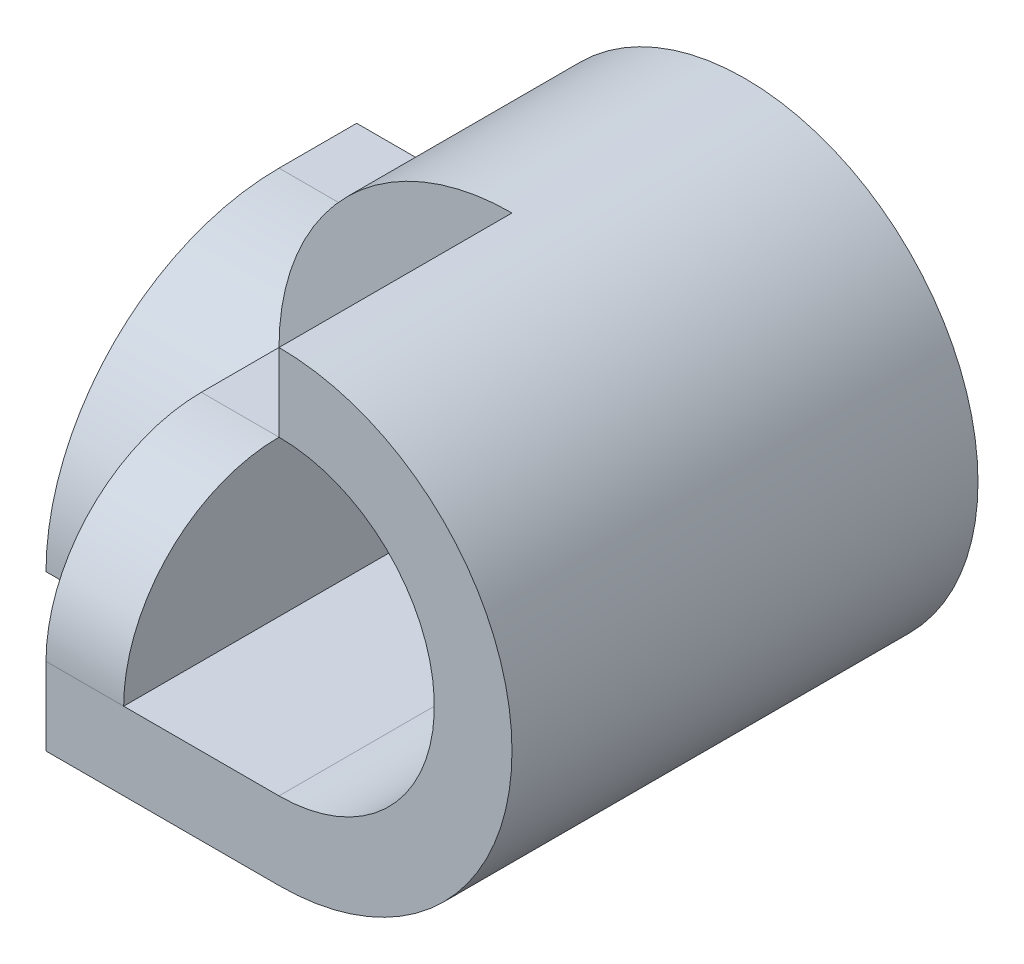
ISO-10303-21;
HEADER;
FILE_DESCRIPTION(('STEP AP214'),'2;1');
FILE_NAME('part.step','',(''),(''),'','','');
FILE_SCHEMA(('AUTOMOTIVE_DESIGN { 1 0 10303 214 1 1 1 1 }'));
ENDSEC;
DATA;
#1=APPLICATION_CONTEXT('core data for automotive mechanical design processes');
#2=APPLICATION_PROTOCOL_DEFINITION('international standard','automotive_design',2000,#1);
#3=PRODUCT_CONTEXT('',#1,'mechanical');
#4=PRODUCT('Part','Part','',(#3));
#5=PRODUCT_RELATED_PRODUCT_CATEGORY('part','',(#4));
#6=PRODUCT_DEFINITION_FORMATION('','',#4);
#7=PRODUCT_DEFINITION_CONTEXT('part definition',#1,'design');
#8=PRODUCT_DEFINITION('design','',#6,#7);
#9=PRODUCT_DEFINITION_SHAPE('','',#8);
#10=(LENGTH_UNIT() NAMED_UNIT(*) SI_UNIT(.MILLI.,.METRE.));
#11=(NAMED_UNIT(*) PLANE_ANGLE_UNIT() SI_UNIT($,.RADIAN.));
#12=(NAMED_UNIT(*) SI_UNIT($,.STERADIAN.) SOLID_ANGLE_UNIT());
#13=UNCERTAINTY_MEASURE_WITH_UNIT(LENGTH_MEASURE(1.E-05),#10,'distance_accuracy_value','');
#14=(GEOMETRIC_REPRESENTATION_CONTEXT(3) GLOBAL_UNCERTAINTY_ASSIGNED_CONTEXT((#13)) GLOBAL_UNIT_ASSIGNED_CONTEXT((#10,
#11,#12)) REPRESENTATION_CONTEXT('',''));
#15=CARTESIAN_POINT('',(0.,0.,0.));
#16=DIRECTION('',(0.,0.,1.));
#17=DIRECTION('',(1.,0.,0.));
#18=AXIS2_PLACEMENT_3D('',#15,#16,#17);
#19=CARTESIAN_POINT('',(-1.,0.,6.));
#20=DIRECTION('',(-1.,0.,0.));
#21=DIRECTION('',(0.,0.,1.));
#22=AXIS2_PLACEMENT_3D('',#19,#20,#21);
#23=PLANE('',#22);
#24=CARTESIAN_POINT('',(-1.,0.,4.));
#25=DIRECTION('',(1.,0.,0.));
#26=DIRECTION('',(0.,0.,-1.));
#27=AXIS2_PLACEMENT_3D('',#24,#25,#26);
#28=CIRCLE('',#27,2.);
#29=CARTESIAN_POINT('',(-1.,2.,4.));
#30=VERTEX_POINT('',#29);
#31=CARTESIAN_POINT('',(-1.,0.,6.));
#32=VERTEX_POINT('',#31);
#33=EDGE_CURVE('E193',#30,#32,#28,.T.);
#34=ORIENTED_EDGE('',*,*,#33,.F.);
#35=DIRECTION('',(0.,0.,1.));
#36=VECTOR('',#35,1.);
#37=CARTESIAN_POINT('',(-1.,2.,3.));
#38=LINE('',#37,#36);
#39=CARTESIAN_POINT('',(-1.,2.,3.));
#40=VERTEX_POINT('',#39);
#41=EDGE_CURVE('E252',#40,#30,#38,.T.);
#42=ORIENTED_EDGE('',*,*,#41,.F.);
#43=DIRECTION('',(0.,0.,-1.));
#44=VECTOR('',#43,1.);
#45=CARTESIAN_POINT('',(-1.,2.,6.));
#46=LINE('',#45,#44);
#47=CARTESIAN_POINT('',(-1.,2.,1.));
#48=VERTEX_POINT('',#47);
#49=EDGE_CURVE('E183',#40,#48,#46,.T.);
#50=ORIENTED_EDGE('',*,*,#49,.T.);
#51=CARTESIAN_POINT('',(-1.,-1.,1.));
#52=DIRECTION('',(-1.,0.,0.));
#53=DIRECTION('',(0.,0.,-1.));
#54=AXIS2_PLACEMENT_3D('',#51,#52,#53);
#55=CIRCLE('',#54,3.);
#56=CARTESIAN_POINT('',(-1.,-0.999999999999999,4.));
#57=VERTEX_POINT('',#56);
#58=EDGE_CURVE('E213',#57,#48,#55,.T.);
#59=ORIENTED_EDGE('',*,*,#58,.F.);
#60=DIRECTION('',(0.,0.,-1.));
#61=VECTOR('',#60,1.);
#62=CARTESIAN_POINT('',(-1.,-1.,6.));
#63=LINE('',#62,#61);
#64=CARTESIAN_POINT('',(-1.,-1.,6.));
#65=VERTEX_POINT('',#64);
#66=EDGE_CURVE('E89',#65,#57,#63,.T.);
#67=ORIENTED_EDGE('',*,*,#66,.F.);
#68=DIRECTION('',(0.,1.,0.));
#69=VECTOR('',#68,1.);
#70=CARTESIAN_POINT('',(-1.,0.,6.));
#71=LINE('',#70,#69);
#72=EDGE_CURVE('E154',#65,#32,#71,.T.);
#73=ORIENTED_EDGE('',*,*,#72,.T.);
#74=EDGE_LOOP('',(#34,#42,#50,#59,#67,#73));
#75=FACE_BOUND('',#74,.T.);
#76=ADVANCED_FACE('F34',(#75),#23,.T.);
#77=CARTESIAN_POINT('',(0.,0.,6.));
#78=DIRECTION('',(-1.,0.,0.));
#79=DIRECTION('',(0.,0.,1.));
#80=AXIS2_PLACEMENT_3D('',#77,#78,#79);
#81=PLANE('',#80);
#82=DIRECTION('',(0.,0.,-1.));
#83=VECTOR('',#82,1.);
#84=CARTESIAN_POINT('',(0.,2.,6.));
#85=LINE('',#84,#83);
#86=CARTESIAN_POINT('',(0.,2.,3.));
#87=VERTEX_POINT('',#86);
#88=CARTESIAN_POINT('',(0.,2.,4.));
#89=VERTEX_POINT('',#88);
#90=EDGE_CURVE('E197',#87,#89,#85,.F.);
#91=ORIENTED_EDGE('',*,*,#90,.T.);
#92=CARTESIAN_POINT('',(0.,0.,4.));
#93=DIRECTION('',(-1.,0.,0.));
#94=DIRECTION('',(0.,0.,1.));
#95=AXIS2_PLACEMENT_3D('',#92,#93,#94);
#96=CIRCLE('',#95,2.);
#97=CARTESIAN_POINT('',(0.,0.,6.));
#98=VERTEX_POINT('',#97);
#99=EDGE_CURVE('E190',#89,#98,#96,.F.);
#100=ORIENTED_EDGE('',*,*,#99,.T.);
#101=DIRECTION('',(0.,0.,-1.));
#102=VECTOR('',#101,1.);
#103=CARTESIAN_POINT('',(0.,0.,6.));
#104=LINE('',#103,#102);
#105=CARTESIAN_POINT('',(0.,0.,0.));
#106=VERTEX_POINT('',#105);
#107=EDGE_CURVE('E82',#98,#106,#104,.T.);
#108=ORIENTED_EDGE('',*,*,#107,.T.);
#109=DIRECTION('',(0.,1.,0.));
#110=VECTOR('',#109,1.);
#111=CARTESIAN_POINT('',(0.,0.,0.));
#112=LINE('',#111,#110);
#113=CARTESIAN_POINT('',(0.,2.,0.));
#114=VERTEX_POINT('',#113);
#115=EDGE_CURVE('E177',#106,#114,#112,.T.);
#116=ORIENTED_EDGE('',*,*,#115,.T.);
#117=DIRECTION('',(0.,0.,-1.));
#118=VECTOR('',#117,1.);
#119=CARTESIAN_POINT('',(0.,2.,6.));
#120=LINE('',#119,#118);
#121=EDGE_CURVE('E140',#87,#114,#120,.T.);
#122=ORIENTED_EDGE('',*,*,#121,.F.);
#123=EDGE_LOOP('',(#91,#100,#108,#116,#122));
#124=FACE_BOUND('',#123,.T.);
#125=ADVANCED_FACE('F195',(#124),#81,.F.);
#126=CARTESIAN_POINT('',(2.,2.,6.));
#127=DIRECTION('',(0.,0.,-1.));
#128=DIRECTION('',(-1.,0.,0.));
#129=AXIS2_PLACEMENT_3D('',#126,#127,#128);
#130=CYLINDRICAL_SURFACE('',#129,2.);
#131=DIRECTION('',(0.,0.,-1.));
#132=VECTOR('',#131,1.);
#133=CARTESIAN_POINT('',(2.,4.,6.));
#134=LINE('',#133,#132);
#135=CARTESIAN_POINT('',(2.,4.,6.));
#136=VERTEX_POINT('',#135);
#137=CARTESIAN_POINT('',(2.,4.,3.));
#138=VERTEX_POINT('',#137);
#139=EDGE_CURVE('E49',#136,#138,#134,.T.);
#140=ORIENTED_EDGE('',*,*,#139,.T.);
#141=CARTESIAN_POINT('',(2.,2.,3.));
#142=DIRECTION('',(0.,0.,-1.));
#143=DIRECTION('',(-1.,0.,0.));
#144=AXIS2_PLACEMENT_3D('',#141,#142,#143);
#145=CIRCLE('',#144,2.);
#146=EDGE_CURVE('E208',#138,#87,#145,.F.);
#147=ORIENTED_EDGE('',*,*,#146,.T.);
#148=ORIENTED_EDGE('',*,*,#121,.T.);
#149=CARTESIAN_POINT('',(2.,2.,0.));
#150=DIRECTION('',(0.,0.,1.));
#151=DIRECTION('',(1.,0.,0.));
#152=AXIS2_PLACEMENT_3D('',#149,#150,#151);
#153=CIRCLE('',#152,2.);
#154=CARTESIAN_POINT('',(2.,0.,0.));
#155=VERTEX_POINT('',#154);
#156=EDGE_CURVE('E159',#114,#155,#153,.F.);
#157=ORIENTED_EDGE('',*,*,#156,.T.);
#158=DIRECTION('',(0.,0.,-1.));
#159=VECTOR('',#158,1.);
#160=CARTESIAN_POINT('',(2.,0.,6.));
#161=LINE('',#160,#159);
#162=CARTESIAN_POINT('',(2.,0.,6.));
#163=VERTEX_POINT('',#162);
#164=EDGE_CURVE('E182',#163,#155,#161,.T.);
#165=ORIENTED_EDGE('',*,*,#164,.F.);
#166=CARTESIAN_POINT('',(2.,2.,6.));
#167=DIRECTION('',(0.,0.,1.));
#168=DIRECTION('',(1.,0.,0.));
#169=AXIS2_PLACEMENT_3D('',#166,#167,#168);
#170=CIRCLE('',#169,2.);
#171=EDGE_CURVE('E57',#136,#163,#170,.F.);
#172=ORIENTED_EDGE('',*,*,#171,.F.);
#173=EDGE_LOOP('',(#140,#147,#148,#157,#165,#172));
#174=FACE_BOUND('',#173,.T.);
#175=ADVANCED_FACE('F207',(#174),#130,.F.);
#176=CARTESIAN_POINT('',(2.,2.,6.));
#177=DIRECTION('',(0.,0.,-1.));
#178=DIRECTION('',(-1.,0.,0.));
#179=AXIS2_PLACEMENT_3D('',#176,#177,#178);
#180=CYLINDRICAL_SURFACE('',#179,3.);
#181=CARTESIAN_POINT('',(2.,2.,3.));
#182=DIRECTION('',(0.,0.,-1.));
#183=DIRECTION('',(-1.,0.,0.));
#184=AXIS2_PLACEMENT_3D('',#181,#182,#183);
#185=CIRCLE('',#184,3.);
#186=CARTESIAN_POINT('',(2.,5.,3.));
#187=VERTEX_POINT('',#186);
#188=EDGE_CURVE('E11',#187,#40,#185,.F.);
#189=ORIENTED_EDGE('',*,*,#188,.F.);
#190=DIRECTION('',(0.,0.,-1.));
#191=VECTOR('',#190,1.);
#192=CARTESIAN_POINT('',(2.,5.,6.));
#193=LINE('',#192,#191);
#194=CARTESIAN_POINT('',(2.,5.,6.));
#195=VERTEX_POINT('',#194);
#196=EDGE_CURVE('E137',#195,#187,#193,.T.);
#197=ORIENTED_EDGE('',*,*,#196,.F.);
#198=CARTESIAN_POINT('',(2.,2.,6.));
#199=DIRECTION('',(0.,0.,1.));
#200=DIRECTION('',(1.,0.,0.));
#201=AXIS2_PLACEMENT_3D('',#198,#199,#200);
#202=CIRCLE('',#201,3.);
#203=CARTESIAN_POINT('',(2.,-1.,6.));
#204=VERTEX_POINT('',#203);
#205=EDGE_CURVE('E143',#195,#204,#202,.F.);
#206=ORIENTED_EDGE('',*,*,#205,.T.);
#207=DIRECTION('',(0.,0.,-1.));
#208=VECTOR('',#207,1.);
#209=CARTESIAN_POINT('',(2.,-1.,6.));
#210=LINE('',#209,#208);
#211=CARTESIAN_POINT('',(2.,-1.,0.));
#212=VERTEX_POINT('',#211);
#213=EDGE_CURVE('E170',#204,#212,#210,.T.);
#214=ORIENTED_EDGE('',*,*,#213,.T.);
#215=CARTESIAN_POINT('',(2.,2.,0.));
#216=DIRECTION('',(0.,0.,1.));
#217=DIRECTION('',(1.,0.,0.));
#218=AXIS2_PLACEMENT_3D('',#215,#216,#217);
#219=CIRCLE('',#218,3.);
#220=CARTESIAN_POINT('',(-1.,2.,0.));
#221=VERTEX_POINT('',#220);
#222=EDGE_CURVE('E171',#221,#212,#219,.F.);
#223=ORIENTED_EDGE('',*,*,#222,.F.);
#224=DIRECTION('',(0.,0.,-1.));
#225=VECTOR('',#224,1.);
#226=CARTESIAN_POINT('',(-1.,2.,0.));
#227=LINE('',#226,#225);
#228=EDGE_CURVE('E211',#48,#221,#227,.T.);
#229=ORIENTED_EDGE('',*,*,#228,.F.);
#230=ORIENTED_EDGE('',*,*,#49,.F.);
#231=EDGE_LOOP('',(#189,#197,#206,#214,#223,#229,#230));
#232=FACE_BOUND('',#231,.T.);
#233=ADVANCED_FACE('F36',(#232),#180,.T.);
#234=CARTESIAN_POINT('',(0.,-1.,6.));
#235=DIRECTION('',(0.,1.,0.));
#236=DIRECTION('',(0.,0.,1.));
#237=AXIS2_PLACEMENT_3D('',#234,#235,#236);
#238=PLANE('',#237);
#239=DIRECTION('',(1.,0.,0.));
#240=VECTOR('',#239,1.);
#241=CARTESIAN_POINT('',(0.,-1.,0.));
#242=LINE('',#241,#240);
#243=CARTESIAN_POINT('',(-3.,-1.,0.));
#244=VERTEX_POINT('',#243);
#245=EDGE_CURVE('E174',#244,#212,#242,.T.);
#246=ORIENTED_EDGE('',*,*,#245,.T.);
#247=ORIENTED_EDGE('',*,*,#213,.F.);
#248=DIRECTION('',(1.,0.,0.));
#249=VECTOR('',#248,1.);
#250=CARTESIAN_POINT('',(0.,-1.,6.));
#251=LINE('',#250,#249);
#252=EDGE_CURVE('E152',#65,#204,#251,.T.);
#253=ORIENTED_EDGE('',*,*,#252,.F.);
#254=ORIENTED_EDGE('',*,*,#66,.T.);
#255=DIRECTION('',(1.,0.,0.));
#256=VECTOR('',#255,1.);
#257=CARTESIAN_POINT('',(-3.,-0.999999999999999,4.));
#258=LINE('',#257,#256);
#259=CARTESIAN_POINT('',(-3.,-0.999999999999999,4.));
#260=VERTEX_POINT('',#259);
#261=EDGE_CURVE('E231',#260,#57,#258,.T.);
#262=ORIENTED_EDGE('',*,*,#261,.F.);
#263=DIRECTION('',(0.,0.,1.));
#264=VECTOR('',#263,1.);
#265=CARTESIAN_POINT('',(-3.,-1.,0.));
#266=LINE('',#265,#264);
#267=EDGE_CURVE('E223',#244,#260,#266,.T.);
#268=ORIENTED_EDGE('',*,*,#267,.F.);
#269=EDGE_LOOP('',(#246,#247,#253,#254,#262,#268));
#270=FACE_BOUND('',#269,.T.);
#271=ADVANCED_FACE('F244',(#270),#238,.F.);
#272=CARTESIAN_POINT('',(0.,0.,6.));
#273=DIRECTION('',(0.,1.,0.));
#274=DIRECTION('',(0.,0.,1.));
#275=AXIS2_PLACEMENT_3D('',#272,#273,#274);
#276=PLANE('',#275);
#277=DIRECTION('',(1.,0.,0.));
#278=VECTOR('',#277,1.);
#279=CARTESIAN_POINT('',(0.,0.,0.));
#280=LINE('',#279,#278);
#281=EDGE_CURVE('E155',#106,#155,#280,.T.);
#282=ORIENTED_EDGE('',*,*,#281,.F.);
#283=ORIENTED_EDGE('',*,*,#107,.F.);
#284=DIRECTION('',(1.,0.,0.));
#285=VECTOR('',#284,1.);
#286=CARTESIAN_POINT('',(0.,0.,6.));
#287=LINE('',#286,#285);
#288=EDGE_CURVE('E167',#98,#163,#287,.T.);
#289=ORIENTED_EDGE('',*,*,#288,.T.);
#290=ORIENTED_EDGE('',*,*,#164,.T.);
#291=EDGE_LOOP('',(#282,#283,#289,#290));
#292=FACE_BOUND('',#291,.T.);
#293=ADVANCED_FACE('F201',(#292),#276,.T.);
#294=CARTESIAN_POINT('',(0.,0.,6.));
#295=DIRECTION('',(0.,0.,1.));
#296=DIRECTION('',(1.,0.,0.));
#297=AXIS2_PLACEMENT_3D('',#294,#295,#296);
#298=PLANE('',#297);
#299=DIRECTION('',(-1.,0.,0.));
#300=VECTOR('',#299,1.);
#301=CARTESIAN_POINT('',(2.,0.,6.));
#302=LINE('',#301,#300);
#303=EDGE_CURVE('E42',#32,#98,#302,.F.);
#304=ORIENTED_EDGE('',*,*,#303,.F.);
#305=ORIENTED_EDGE('',*,*,#72,.F.);
#306=ORIENTED_EDGE('',*,*,#252,.T.);
#307=ORIENTED_EDGE('',*,*,#205,.F.);
#308=DIRECTION('',(0.,1.,0.));
#309=VECTOR('',#308,1.);
#310=CARTESIAN_POINT('',(2.,0.,6.));
#311=LINE('',#310,#309);
#312=EDGE_CURVE('E134',#136,#195,#311,.T.);
#313=ORIENTED_EDGE('',*,*,#312,.F.);
#314=ORIENTED_EDGE('',*,*,#171,.T.);
#315=ORIENTED_EDGE('',*,*,#288,.F.);
#316=EDGE_LOOP('',(#304,#305,#306,#307,#313,#314,#315));
#317=FACE_BOUND('',#316,.T.);
#318=ADVANCED_FACE('F150',(#317),#298,.T.);
#319=CARTESIAN_POINT('',(0.,0.,0.));
#320=DIRECTION('',(0.,0.,1.));
#321=DIRECTION('',(1.,0.,0.));
#322=AXIS2_PLACEMENT_3D('',#319,#320,#321);
#323=PLANE('',#322);
#324=ORIENTED_EDGE('',*,*,#222,.T.);
#325=ORIENTED_EDGE('',*,*,#245,.F.);
#326=DIRECTION('',(0.,-1.,0.));
#327=VECTOR('',#326,1.);
#328=CARTESIAN_POINT('',(-3.,2.,0.));
#329=LINE('',#328,#327);
#330=CARTESIAN_POINT('',(-3.,2.,0.));
#331=VERTEX_POINT('',#330);
#332=EDGE_CURVE('E220',#331,#244,#329,.T.);
#333=ORIENTED_EDGE('',*,*,#332,.F.);
#334=DIRECTION('',(1.,0.,0.));
#335=VECTOR('',#334,1.);
#336=CARTESIAN_POINT('',(-3.,2.,0.));
#337=LINE('',#336,#335);
#338=EDGE_CURVE('E162',#331,#221,#337,.T.);
#339=ORIENTED_EDGE('',*,*,#338,.T.);
#340=EDGE_LOOP('',(#324,#325,#333,#339));
#341=FACE_BOUND('',#340,.T.);
#342=ORIENTED_EDGE('',*,*,#115,.F.);
#343=ORIENTED_EDGE('',*,*,#281,.T.);
#344=ORIENTED_EDGE('',*,*,#156,.F.);
#345=EDGE_LOOP('',(#342,#343,#344));
#346=FACE_BOUND('',#345,.T.);
#347=ADVANCED_FACE('F204',(#341,#346),#323,.F.);
#348=CARTESIAN_POINT('',(-3.,2.,0.));
#349=DIRECTION('',(0.,-1.,0.));
#350=DIRECTION('',(0.,0.,-1.));
#351=AXIS2_PLACEMENT_3D('',#348,#349,#350);
#352=PLANE('',#351);
#353=ORIENTED_EDGE('',*,*,#228,.T.);
#354=ORIENTED_EDGE('',*,*,#338,.F.);
#355=DIRECTION('',(0.,0.,-1.));
#356=VECTOR('',#355,1.);
#357=CARTESIAN_POINT('',(-3.,2.,0.));
#358=LINE('',#357,#356);
#359=CARTESIAN_POINT('',(-3.,2.,1.));
#360=VERTEX_POINT('',#359);
#361=EDGE_CURVE('E217',#360,#331,#358,.T.);
#362=ORIENTED_EDGE('',*,*,#361,.F.);
#363=DIRECTION('',(1.,0.,0.));
#364=VECTOR('',#363,1.);
#365=CARTESIAN_POINT('',(-3.,2.,1.));
#366=LINE('',#365,#364);
#367=EDGE_CURVE('E226',#360,#48,#366,.T.);
#368=ORIENTED_EDGE('',*,*,#367,.T.);
#369=EDGE_LOOP('',(#353,#354,#362,#368));
#370=FACE_BOUND('',#369,.T.);
#371=ADVANCED_FACE('F248',(#370),#352,.F.);
#372=CARTESIAN_POINT('',(-3.,-1.,1.));
#373=DIRECTION('',(1.,0.,0.));
#374=DIRECTION('',(0.,0.,-1.));
#375=AXIS2_PLACEMENT_3D('',#372,#373,#374);
#376=CYLINDRICAL_SURFACE('',#375,3.);
#377=ORIENTED_EDGE('',*,*,#58,.T.);
#378=ORIENTED_EDGE('',*,*,#367,.F.);
#379=CARTESIAN_POINT('',(-3.,-1.,1.));
#380=DIRECTION('',(-1.,0.,0.));
#381=DIRECTION('',(0.,0.,-1.));
#382=AXIS2_PLACEMENT_3D('',#379,#380,#381);
#383=CIRCLE('',#382,3.);
#384=EDGE_CURVE('E225',#260,#360,#383,.T.);
#385=ORIENTED_EDGE('',*,*,#384,.F.);
#386=ORIENTED_EDGE('',*,*,#261,.T.);
#387=EDGE_LOOP('',(#377,#378,#385,#386));
#388=FACE_BOUND('',#387,.T.);
#389=ADVANCED_FACE('F249',(#388),#376,.T.);
#390=CARTESIAN_POINT('',(-3.,-1.,1.));
#391=DIRECTION('',(1.,0.,0.));
#392=DIRECTION('',(0.,0.,-1.));
#393=AXIS2_PLACEMENT_3D('',#390,#391,#392);
#394=PLANE('',#393);
#395=ORIENTED_EDGE('',*,*,#361,.T.);
#396=ORIENTED_EDGE('',*,*,#332,.T.);
#397=ORIENTED_EDGE('',*,*,#267,.T.);
#398=ORIENTED_EDGE('',*,*,#384,.T.);
#399=EDGE_LOOP('',(#395,#396,#397,#398));
#400=FACE_BOUND('',#399,.T.);
#401=ADVANCED_FACE('F246',(#400),#394,.F.);
#402=CARTESIAN_POINT('',(2.,5.,3.));
#403=DIRECTION('',(0.,0.,-1.));
#404=DIRECTION('',(-1.,0.,0.));
#405=AXIS2_PLACEMENT_3D('',#402,#403,#404);
#406=PLANE('',#405);
#407=DIRECTION('',(0.,-1.,0.));
#408=VECTOR('',#407,1.);
#409=CARTESIAN_POINT('',(2.,5.,3.));
#410=LINE('',#409,#408);
#411=EDGE_CURVE('E147',#187,#138,#410,.T.);
#412=ORIENTED_EDGE('',*,*,#411,.F.);
#413=ORIENTED_EDGE('',*,*,#188,.T.);
#414=DIRECTION('',(-1.,0.,0.));
#415=VECTOR('',#414,1.);
#416=CARTESIAN_POINT('',(2.,2.,3.));
#417=LINE('',#416,#415);
#418=EDGE_CURVE('E146',#87,#40,#417,.T.);
#419=ORIENTED_EDGE('',*,*,#418,.F.);
#420=ORIENTED_EDGE('',*,*,#146,.F.);
#421=EDGE_LOOP('',(#412,#413,#419,#420));
#422=FACE_BOUND('',#421,.T.);
#423=ADVANCED_FACE('F263',(#422),#406,.F.);
#424=CARTESIAN_POINT('',(2.,2.,3.));
#425=DIRECTION('',(0.,-1.,0.));
#426=DIRECTION('',(0.,0.,-1.));
#427=AXIS2_PLACEMENT_3D('',#424,#425,#426);
#428=PLANE('',#427);
#429=ORIENTED_EDGE('',*,*,#418,.T.);
#430=ORIENTED_EDGE('',*,*,#41,.T.);
#431=DIRECTION('',(-1.,0.,0.));
#432=VECTOR('',#431,1.);
#433=CARTESIAN_POINT('',(2.,2.,4.));
#434=LINE('',#433,#432);
#435=EDGE_CURVE('E257',#89,#30,#434,.T.);
#436=ORIENTED_EDGE('',*,*,#435,.F.);
#437=ORIENTED_EDGE('',*,*,#90,.F.);
#438=EDGE_LOOP('',(#429,#430,#436,#437));
#439=FACE_BOUND('',#438,.T.);
#440=ADVANCED_FACE('F262',(#439),#428,.F.);
#441=CARTESIAN_POINT('',(2.,0.,4.));
#442=DIRECTION('',(-1.,0.,0.));
#443=DIRECTION('',(0.,0.,1.));
#444=AXIS2_PLACEMENT_3D('',#441,#442,#443);
#445=CYLINDRICAL_SURFACE('',#444,2.);
#446=ORIENTED_EDGE('',*,*,#435,.T.);
#447=ORIENTED_EDGE('',*,*,#33,.T.);
#448=ORIENTED_EDGE('',*,*,#303,.T.);
#449=ORIENTED_EDGE('',*,*,#99,.F.);
#450=EDGE_LOOP('',(#446,#447,#448,#449));
#451=FACE_BOUND('',#450,.T.);
#452=ADVANCED_FACE('F189',(#451),#445,.T.);
#453=CARTESIAN_POINT('',(2.,0.,4.));
#454=DIRECTION('',(1.,0.,0.));
#455=DIRECTION('',(0.,0.,-1.));
#456=AXIS2_PLACEMENT_3D('',#453,#454,#455);
#457=PLANE('',#456);
#458=ORIENTED_EDGE('',*,*,#312,.T.);
#459=ORIENTED_EDGE('',*,*,#196,.T.);
#460=ORIENTED_EDGE('',*,*,#411,.T.);
#461=ORIENTED_EDGE('',*,*,#139,.F.);
#462=EDGE_LOOP('',(#458,#459,#460,#461));
#463=FACE_BOUND('',#462,.T.);
#464=ADVANCED_FACE('F136',(#463),#457,.F.);
#465=CLOSED_SHELL('',(#76,#125,#175,#233,#271,#293,#318,#347,#371,#389,#401,#423,#440,#452,#464));
#466=MANIFOLD_SOLID_BREP('B2',#465);
#467=ADVANCED_BREP_SHAPE_REPRESENTATION('',(#18,#466),#14);
#468=SHAPE_DEFINITION_REPRESENTATION(#9,#467);
ENDSEC;
END-ISO-10303-21;
